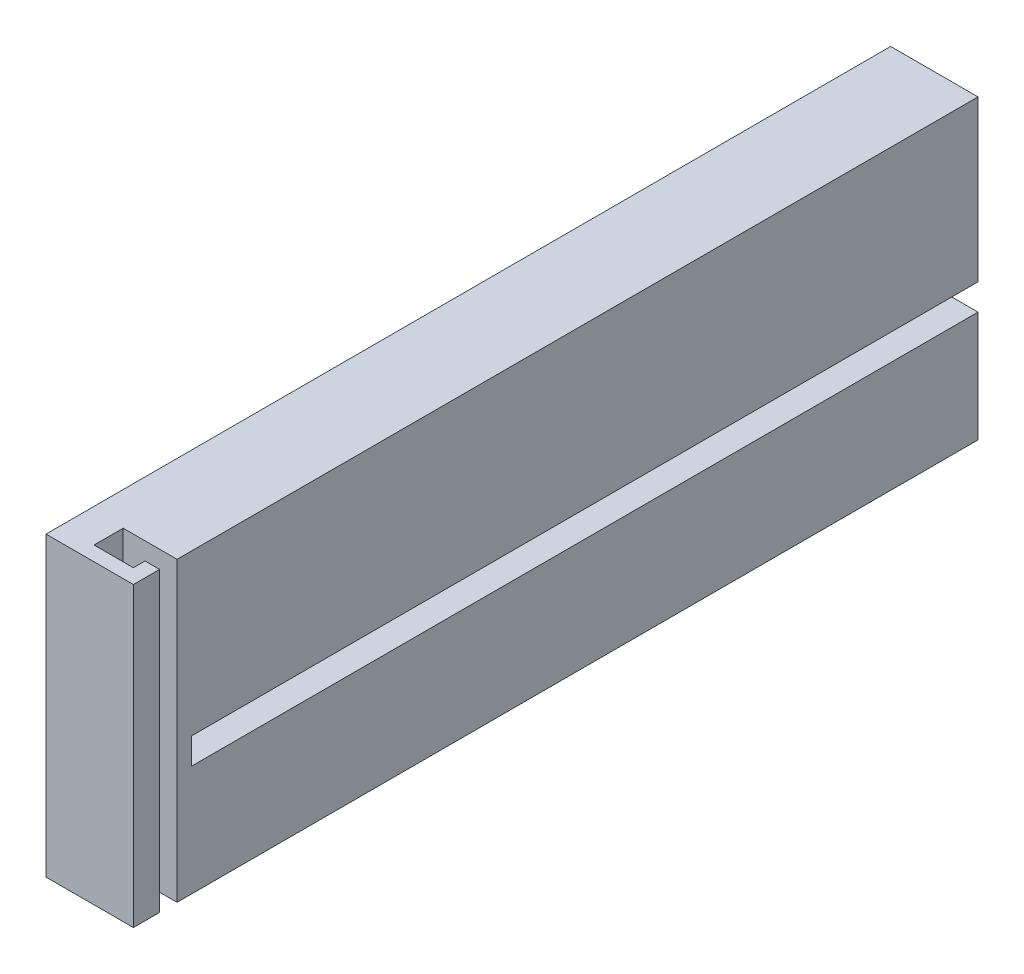
ISO-10303-21;
HEADER;
FILE_DESCRIPTION(('STEP AP214'),'2;1');
FILE_NAME('part.step','',(''),(''),'','','');
FILE_SCHEMA(('AUTOMOTIVE_DESIGN { 1 0 10303 214 1 1 1 1 }'));
ENDSEC;
DATA;
#1=APPLICATION_CONTEXT('core data for automotive mechanical design processes');
#2=APPLICATION_PROTOCOL_DEFINITION('international standard','automotive_design',2000,#1);
#3=PRODUCT_CONTEXT('',#1,'mechanical');
#4=PRODUCT('Part','Part','',(#3));
#5=PRODUCT_RELATED_PRODUCT_CATEGORY('part','',(#4));
#6=PRODUCT_DEFINITION_FORMATION('','',#4);
#7=PRODUCT_DEFINITION_CONTEXT('part definition',#1,'design');
#8=PRODUCT_DEFINITION('design','',#6,#7);
#9=PRODUCT_DEFINITION_SHAPE('','',#8);
#10=(LENGTH_UNIT() NAMED_UNIT(*) SI_UNIT(.MILLI.,.METRE.));
#11=(NAMED_UNIT(*) PLANE_ANGLE_UNIT() SI_UNIT($,.RADIAN.));
#12=(NAMED_UNIT(*) SI_UNIT($,.STERADIAN.) SOLID_ANGLE_UNIT());
#13=UNCERTAINTY_MEASURE_WITH_UNIT(LENGTH_MEASURE(1.E-05),#10,'distance_accuracy_value','');
#14=(GEOMETRIC_REPRESENTATION_CONTEXT(3) GLOBAL_UNCERTAINTY_ASSIGNED_CONTEXT((#13)) GLOBAL_UNIT_ASSIGNED_CONTEXT((#10,
#11,#12)) REPRESENTATION_CONTEXT('',''));
#15=CARTESIAN_POINT('',(0.,0.,0.));
#16=DIRECTION('',(0.,0.,1.));
#17=DIRECTION('',(1.,0.,0.));
#18=AXIS2_PLACEMENT_3D('',#15,#16,#17);
#19=CARTESIAN_POINT('',(15.,0.,0.));
#20=DIRECTION('',(-1.,0.,0.));
#21=DIRECTION('',(0.,0.,1.));
#22=AXIS2_PLACEMENT_3D('',#19,#20,#21);
#23=PLANE('',#22);
#24=DIRECTION('',(0.,0.,-1.));
#25=VECTOR('',#24,1.);
#26=CARTESIAN_POINT('',(15.,-1.4427333974976,54.5620789220404));
#27=LINE('',#26,#25);
#28=CARTESIAN_POINT('',(15.,-1.4427333974976,54.5620789220404));
#29=VERTEX_POINT('',#28);
#30=CARTESIAN_POINT('',(15.,-1.44273339749769,-80.4379210779596));
#31=VERTEX_POINT('',#30);
#32=EDGE_CURVE('E183',#29,#31,#27,.T.);
#33=ORIENTED_EDGE('',*,*,#32,.F.);
#34=DIRECTION('',(0.,-1.,0.));
#35=VECTOR('',#34,1.);
#36=CARTESIAN_POINT('',(15.,0.,54.5620789220404));
#37=LINE('',#36,#35);
#38=CARTESIAN_POINT('',(15.,3.0572666025024,54.5620789220404));
#39=VERTEX_POINT('',#38);
#40=EDGE_CURVE('E163',#39,#29,#37,.T.);
#41=ORIENTED_EDGE('',*,*,#40,.F.);
#42=DIRECTION('',(0.,0.,-1.));
#43=VECTOR('',#42,1.);
#44=CARTESIAN_POINT('',(15.,3.0572666025024,54.5620789220404));
#45=LINE('',#44,#43);
#46=CARTESIAN_POINT('',(15.,3.05726660250231,-80.4379210779596));
#47=VERTEX_POINT('',#46);
#48=EDGE_CURVE('E187',#39,#47,#45,.T.);
#49=ORIENTED_EDGE('',*,*,#48,.T.);
#50=DIRECTION('',(0.,-1.,0.));
#51=VECTOR('',#50,1.);
#52=CARTESIAN_POINT('',(15.,30.5572666025024,-80.4379210779596));
#53=LINE('',#52,#51);
#54=CARTESIAN_POINT('',(15.,30.5572666025024,-80.4379210779596));
#55=VERTEX_POINT('',#54);
#56=EDGE_CURVE('E255',#55,#47,#53,.T.);
#57=ORIENTED_EDGE('',*,*,#56,.F.);
#58=DIRECTION('',(0.,0.,-1.));
#59=VECTOR('',#58,1.);
#60=CARTESIAN_POINT('',(15.,30.5572666025024,64.5620789220404));
#61=LINE('',#60,#59);
#62=CARTESIAN_POINT('',(15.,30.5572666025024,57.0620789220404));
#63=VERTEX_POINT('',#62);
#64=EDGE_CURVE('E254',#63,#55,#61,.T.);
#65=ORIENTED_EDGE('',*,*,#64,.F.);
#66=DIRECTION('',(0.,1.,0.));
#67=VECTOR('',#66,1.);
#68=CARTESIAN_POINT('',(15.,-20.4427333974976,57.0620789220404));
#69=LINE('',#68,#67);
#70=CARTESIAN_POINT('',(15.,-20.4427333974976,57.0620789220404));
#71=VERTEX_POINT('',#70);
#72=EDGE_CURVE('E241',#71,#63,#69,.T.);
#73=ORIENTED_EDGE('',*,*,#72,.F.);
#74=DIRECTION('',(0.,0.,-1.));
#75=VECTOR('',#74,1.);
#76=CARTESIAN_POINT('',(15.,-20.4427333974976,64.5620789220404));
#77=LINE('',#76,#75);
#78=CARTESIAN_POINT('',(15.,-20.4427333974976,-80.4379210779596));
#79=VERTEX_POINT('',#78);
#80=EDGE_CURVE('E259',#71,#79,#77,.T.);
#81=ORIENTED_EDGE('',*,*,#80,.T.);
#82=EDGE_CURVE('E253',#31,#79,#53,.T.);
#83=ORIENTED_EDGE('',*,*,#82,.F.);
#84=EDGE_LOOP('',(#33,#41,#49,#57,#65,#73,#81,#83));
#85=FACE_BOUND('',#84,.T.);
#86=ADVANCED_FACE('F43',(#85),#23,.F.);
#87=CARTESIAN_POINT('',(15.,30.5572666025024,-80.4379210779596));
#88=DIRECTION('',(0.,0.,-1.));
#89=DIRECTION('',(-1.,0.,0.));
#90=AXIS2_PLACEMENT_3D('',#87,#88,#89);
#91=PLANE('',#90);
#92=DIRECTION('',(0.,-1.,0.));
#93=VECTOR('',#92,1.);
#94=CARTESIAN_POINT('',(10.,0.,-80.4379210779596));
#95=LINE('',#94,#93);
#96=CARTESIAN_POINT('',(10.,3.05726660250231,-80.4379210779596));
#97=VERTEX_POINT('',#96);
#98=CARTESIAN_POINT('',(10.,-1.44273339749769,-80.4379210779596));
#99=VERTEX_POINT('',#98);
#100=EDGE_CURVE('E172',#97,#99,#95,.T.);
#101=ORIENTED_EDGE('',*,*,#100,.T.);
#102=DIRECTION('',(1.,0.,0.));
#103=VECTOR('',#102,1.);
#104=CARTESIAN_POINT('',(0.,-1.44273339749768,-80.4379210779596));
#105=LINE('',#104,#103);
#106=EDGE_CURVE('E61',#99,#31,#105,.T.);
#107=ORIENTED_EDGE('',*,*,#106,.T.);
#108=ORIENTED_EDGE('',*,*,#82,.T.);
#109=DIRECTION('',(-1.,0.,0.));
#110=VECTOR('',#109,1.);
#111=CARTESIAN_POINT('',(15.,-20.4427333974976,-80.4379210779596));
#112=LINE('',#111,#110);
#113=CARTESIAN_POINT('',(0.,-20.4427333974976,-80.4379210779596));
#114=VERTEX_POINT('',#113);
#115=EDGE_CURVE('E283',#79,#114,#112,.T.);
#116=ORIENTED_EDGE('',*,*,#115,.T.);
#117=DIRECTION('',(0.,-1.,0.));
#118=VECTOR('',#117,1.);
#119=CARTESIAN_POINT('',(0.,30.5572666025024,-80.4379210779596));
#120=LINE('',#119,#118);
#121=CARTESIAN_POINT('',(0.,30.5572666025024,-80.4379210779596));
#122=VERTEX_POINT('',#121);
#123=EDGE_CURVE('E270',#122,#114,#120,.T.);
#124=ORIENTED_EDGE('',*,*,#123,.F.);
#125=DIRECTION('',(-1.,0.,0.));
#126=VECTOR('',#125,1.);
#127=CARTESIAN_POINT('',(15.,30.5572666025024,-80.4379210779596));
#128=LINE('',#127,#126);
#129=EDGE_CURVE('E47',#55,#122,#128,.T.);
#130=ORIENTED_EDGE('',*,*,#129,.F.);
#131=ORIENTED_EDGE('',*,*,#56,.T.);
#132=DIRECTION('',(1.,0.,0.));
#133=VECTOR('',#132,1.);
#134=CARTESIAN_POINT('',(0.,3.05726660250232,-80.4379210779596));
#135=LINE('',#134,#133);
#136=EDGE_CURVE('E169',#97,#47,#135,.T.);
#137=ORIENTED_EDGE('',*,*,#136,.F.);
#138=EDGE_LOOP('',(#101,#107,#108,#116,#124,#130,#131,#137));
#139=FACE_BOUND('',#138,.T.);
#140=ADVANCED_FACE('F295',(#139),#91,.T.);
#141=CARTESIAN_POINT('',(15.,30.5572666025024,64.5620789220404));
#142=DIRECTION('',(0.,1.,0.));
#143=DIRECTION('',(0.,0.,1.));
#144=AXIS2_PLACEMENT_3D('',#141,#142,#143);
#145=PLANE('',#144);
#146=DIRECTION('',(-1.,0.,0.));
#147=VECTOR('',#146,1.);
#148=CARTESIAN_POINT('',(0.,30.5572666025024,57.0620789220404));
#149=LINE('',#148,#147);
#150=CARTESIAN_POINT('',(5.75,30.5572666025024,57.0620789220404));
#151=VERTEX_POINT('',#150);
#152=EDGE_CURVE('E220',#63,#151,#149,.T.);
#153=ORIENTED_EDGE('',*,*,#152,.F.);
#154=ORIENTED_EDGE('',*,*,#64,.T.);
#155=ORIENTED_EDGE('',*,*,#129,.T.);
#156=DIRECTION('',(0.,0.,-1.));
#157=VECTOR('',#156,1.);
#158=CARTESIAN_POINT('',(0.,30.5572666025024,64.5620789220404));
#159=LINE('',#158,#157);
#160=CARTESIAN_POINT('',(0.,30.5572666025024,64.5620789220404));
#161=VERTEX_POINT('',#160);
#162=EDGE_CURVE('E234',#161,#122,#159,.T.);
#163=ORIENTED_EDGE('',*,*,#162,.F.);
#164=DIRECTION('',(-1.,0.,0.));
#165=VECTOR('',#164,1.);
#166=CARTESIAN_POINT('',(15.,30.5572666025024,64.5620789220404));
#167=LINE('',#166,#165);
#168=CARTESIAN_POINT('',(15.,30.5572666025024,64.5620789220404));
#169=VERTEX_POINT('',#168);
#170=EDGE_CURVE('E11',#169,#161,#167,.T.);
#171=ORIENTED_EDGE('',*,*,#170,.F.);
#172=CARTESIAN_POINT('',(15.,30.5572666025024,60.0620789220404));
#173=VERTEX_POINT('',#172);
#174=EDGE_CURVE('E249',#169,#173,#61,.T.);
#175=ORIENTED_EDGE('',*,*,#174,.T.);
#176=DIRECTION('',(1.,0.,0.));
#177=VECTOR('',#176,1.);
#178=CARTESIAN_POINT('',(0.,30.5572666025024,60.0620789220404));
#179=LINE('',#178,#177);
#180=CARTESIAN_POINT('',(12.5,30.5572666025024,60.0620789220404));
#181=VERTEX_POINT('',#180);
#182=EDGE_CURVE('E69',#181,#173,#179,.T.);
#183=ORIENTED_EDGE('',*,*,#182,.F.);
#184=DIRECTION('',(0.,0.,-1.));
#185=VECTOR('',#184,1.);
#186=CARTESIAN_POINT('',(12.5,30.5572666025024,0.));
#187=LINE('',#186,#185);
#188=CARTESIAN_POINT('',(12.5,30.5572666025024,62.0620789220404));
#189=VERTEX_POINT('',#188);
#190=EDGE_CURVE('E186',#189,#181,#187,.T.);
#191=ORIENTED_EDGE('',*,*,#190,.F.);
#192=DIRECTION('',(1.,0.,0.));
#193=VECTOR('',#192,1.);
#194=CARTESIAN_POINT('',(0.,30.5572666025024,62.0620789220404));
#195=LINE('',#194,#193);
#196=CARTESIAN_POINT('',(5.75,30.5572666025024,62.0620789220404));
#197=VERTEX_POINT('',#196);
#198=EDGE_CURVE('E198',#197,#189,#195,.T.);
#199=ORIENTED_EDGE('',*,*,#198,.F.);
#200=DIRECTION('',(0.,0.,1.));
#201=VECTOR('',#200,1.);
#202=CARTESIAN_POINT('',(5.75,30.5572666025024,0.));
#203=LINE('',#202,#201);
#204=EDGE_CURVE('E224',#151,#197,#203,.T.);
#205=ORIENTED_EDGE('',*,*,#204,.F.);
#206=EDGE_LOOP('',(#153,#154,#155,#163,#171,#175,#183,#191,#199,#205));
#207=FACE_BOUND('',#206,.T.);
#208=ADVANCED_FACE('F45',(#207),#145,.T.);
#209=CARTESIAN_POINT('',(15.,30.5572666025024,64.5620789220404));
#210=DIRECTION('',(0.,0.,-1.));
#211=DIRECTION('',(-1.,0.,0.));
#212=AXIS2_PLACEMENT_3D('',#209,#210,#211);
#213=PLANE('',#212);
#214=DIRECTION('',(0.,-1.,0.));
#215=VECTOR('',#214,1.);
#216=CARTESIAN_POINT('',(0.,30.5572666025024,64.5620789220404));
#217=LINE('',#216,#215);
#218=CARTESIAN_POINT('',(0.,-20.4427333974976,64.5620789220404));
#219=VERTEX_POINT('',#218);
#220=EDGE_CURVE('E278',#161,#219,#217,.T.);
#221=ORIENTED_EDGE('',*,*,#220,.T.);
#222=DIRECTION('',(-1.,0.,0.));
#223=VECTOR('',#222,1.);
#224=CARTESIAN_POINT('',(15.,-20.4427333974976,64.5620789220404));
#225=LINE('',#224,#223);
#226=CARTESIAN_POINT('',(15.,-20.4427333974976,64.5620789220404));
#227=VERTEX_POINT('',#226);
#228=EDGE_CURVE('E53',#227,#219,#225,.T.);
#229=ORIENTED_EDGE('',*,*,#228,.F.);
#230=DIRECTION('',(0.,-1.,0.));
#231=VECTOR('',#230,1.);
#232=CARTESIAN_POINT('',(15.,30.5572666025024,64.5620789220404));
#233=LINE('',#232,#231);
#234=EDGE_CURVE('E264',#169,#227,#233,.T.);
#235=ORIENTED_EDGE('',*,*,#234,.F.);
#236=ORIENTED_EDGE('',*,*,#170,.T.);
#237=EDGE_LOOP('',(#221,#229,#235,#236));
#238=FACE_BOUND('',#237,.T.);
#239=ADVANCED_FACE('F302',(#238),#213,.F.);
#240=CARTESIAN_POINT('',(15.,-20.4427333974976,64.5620789220404));
#241=DIRECTION('',(0.,1.,0.));
#242=DIRECTION('',(0.,0.,1.));
#243=AXIS2_PLACEMENT_3D('',#240,#241,#242);
#244=PLANE('',#243);
#245=ORIENTED_EDGE('',*,*,#80,.F.);
#246=DIRECTION('',(-1.,0.,0.));
#247=VECTOR('',#246,1.);
#248=CARTESIAN_POINT('',(0.,-20.4427333974976,57.0620789220404));
#249=LINE('',#248,#247);
#250=CARTESIAN_POINT('',(5.75,-20.4427333974976,57.0620789220404));
#251=VERTEX_POINT('',#250);
#252=EDGE_CURVE('E202',#71,#251,#249,.T.);
#253=ORIENTED_EDGE('',*,*,#252,.T.);
#254=DIRECTION('',(0.,0.,1.));
#255=VECTOR('',#254,1.);
#256=CARTESIAN_POINT('',(5.75,-20.4427333974976,0.));
#257=LINE('',#256,#255);
#258=CARTESIAN_POINT('',(5.75,-20.4427333974976,62.0620789220404));
#259=VERTEX_POINT('',#258);
#260=EDGE_CURVE('E206',#251,#259,#257,.T.);
#261=ORIENTED_EDGE('',*,*,#260,.T.);
#262=DIRECTION('',(1.,0.,0.));
#263=VECTOR('',#262,1.);
#264=CARTESIAN_POINT('',(0.,-20.4427333974976,62.0620789220404));
#265=LINE('',#264,#263);
#266=CARTESIAN_POINT('',(12.5,-20.4427333974976,62.0620789220404));
#267=VERTEX_POINT('',#266);
#268=EDGE_CURVE('E210',#259,#267,#265,.T.);
#269=ORIENTED_EDGE('',*,*,#268,.T.);
#270=DIRECTION('',(0.,0.,-1.));
#271=VECTOR('',#270,1.);
#272=CARTESIAN_POINT('',(12.5,-20.4427333974976,0.));
#273=LINE('',#272,#271);
#274=CARTESIAN_POINT('',(12.5,-20.4427333974976,60.0620789220404));
#275=VERTEX_POINT('',#274);
#276=EDGE_CURVE('E193',#267,#275,#273,.T.);
#277=ORIENTED_EDGE('',*,*,#276,.T.);
#278=DIRECTION('',(1.,0.,0.));
#279=VECTOR('',#278,1.);
#280=CARTESIAN_POINT('',(0.,-20.4427333974976,60.0620789220404));
#281=LINE('',#280,#279);
#282=CARTESIAN_POINT('',(15.,-20.4427333974976,60.0620789220404));
#283=VERTEX_POINT('',#282);
#284=EDGE_CURVE('E197',#275,#283,#281,.T.);
#285=ORIENTED_EDGE('',*,*,#284,.T.);
#286=EDGE_CURVE('E260',#227,#283,#77,.T.);
#287=ORIENTED_EDGE('',*,*,#286,.F.);
#288=ORIENTED_EDGE('',*,*,#228,.T.);
#289=DIRECTION('',(0.,0.,-1.));
#290=VECTOR('',#289,1.);
#291=CARTESIAN_POINT('',(0.,-20.4427333974976,64.5620789220404));
#292=LINE('',#291,#290);
#293=EDGE_CURVE('E274',#219,#114,#292,.T.);
#294=ORIENTED_EDGE('',*,*,#293,.T.);
#295=ORIENTED_EDGE('',*,*,#115,.F.);
#296=EDGE_LOOP('',(#245,#253,#261,#269,#277,#285,#287,#288,#294,#295));
#297=FACE_BOUND('',#296,.T.);
#298=ADVANCED_FACE('F307',(#297),#244,.F.);
#299=ORIENTED_EDGE('',*,*,#286,.T.);
#300=DIRECTION('',(0.,1.,0.));
#301=VECTOR('',#300,1.);
#302=CARTESIAN_POINT('',(15.,-20.4427333974976,60.0620789220404));
#303=LINE('',#302,#301);
#304=EDGE_CURVE('E244',#283,#173,#303,.T.);
#305=ORIENTED_EDGE('',*,*,#304,.T.);
#306=ORIENTED_EDGE('',*,*,#174,.F.);
#307=ORIENTED_EDGE('',*,*,#234,.T.);
#308=EDGE_LOOP('',(#299,#305,#306,#307));
#309=FACE_BOUND('',#308,.T.);
#310=ADVANCED_FACE('F310',(#309),#23,.F.);
#311=CARTESIAN_POINT('',(0.,0.,0.));
#312=DIRECTION('',(-1.,0.,0.));
#313=DIRECTION('',(0.,0.,1.));
#314=AXIS2_PLACEMENT_3D('',#311,#312,#313);
#315=PLANE('',#314);
#316=ORIENTED_EDGE('',*,*,#162,.T.);
#317=ORIENTED_EDGE('',*,*,#123,.T.);
#318=ORIENTED_EDGE('',*,*,#293,.F.);
#319=ORIENTED_EDGE('',*,*,#220,.F.);
#320=EDGE_LOOP('',(#316,#317,#318,#319));
#321=FACE_BOUND('',#320,.T.);
#322=ADVANCED_FACE('F299',(#321),#315,.T.);
#323=CARTESIAN_POINT('',(12.5,-20.4427333974976,0.));
#324=DIRECTION('',(1.,0.,0.));
#325=DIRECTION('',(0.,0.,-1.));
#326=AXIS2_PLACEMENT_3D('',#323,#324,#325);
#327=PLANE('',#326);
#328=ORIENTED_EDGE('',*,*,#190,.T.);
#329=DIRECTION('',(0.,1.,0.));
#330=VECTOR('',#329,1.);
#331=CARTESIAN_POINT('',(12.5,-20.4427333974976,60.0620789220404));
#332=LINE('',#331,#330);
#333=EDGE_CURVE('E214',#275,#181,#332,.T.);
#334=ORIENTED_EDGE('',*,*,#333,.F.);
#335=ORIENTED_EDGE('',*,*,#276,.F.);
#336=DIRECTION('',(0.,1.,0.));
#337=VECTOR('',#336,1.);
#338=CARTESIAN_POINT('',(12.5,-20.4427333974976,62.0620789220404));
#339=LINE('',#338,#337);
#340=EDGE_CURVE('E231',#267,#189,#339,.T.);
#341=ORIENTED_EDGE('',*,*,#340,.T.);
#342=EDGE_LOOP('',(#328,#334,#335,#341));
#343=FACE_BOUND('',#342,.T.);
#344=ADVANCED_FACE('F316',(#343),#327,.F.);
#345=CARTESIAN_POINT('',(0.,-20.4427333974976,62.0620789220404));
#346=DIRECTION('',(0.,0.,1.));
#347=DIRECTION('',(1.,0.,0.));
#348=AXIS2_PLACEMENT_3D('',#345,#346,#347);
#349=PLANE('',#348);
#350=ORIENTED_EDGE('',*,*,#198,.T.);
#351=ORIENTED_EDGE('',*,*,#340,.F.);
#352=ORIENTED_EDGE('',*,*,#268,.F.);
#353=DIRECTION('',(0.,1.,0.));
#354=VECTOR('',#353,1.);
#355=CARTESIAN_POINT('',(5.75,-20.4427333974976,62.0620789220404));
#356=LINE('',#355,#354);
#357=EDGE_CURVE('E235',#259,#197,#356,.T.);
#358=ORIENTED_EDGE('',*,*,#357,.T.);
#359=EDGE_LOOP('',(#350,#351,#352,#358));
#360=FACE_BOUND('',#359,.T.);
#361=ADVANCED_FACE('F320',(#360),#349,.F.);
#362=CARTESIAN_POINT('',(5.75,-20.4427333974976,0.));
#363=DIRECTION('',(-1.,0.,0.));
#364=DIRECTION('',(0.,0.,1.));
#365=AXIS2_PLACEMENT_3D('',#362,#363,#364);
#366=PLANE('',#365);
#367=ORIENTED_EDGE('',*,*,#204,.T.);
#368=ORIENTED_EDGE('',*,*,#357,.F.);
#369=ORIENTED_EDGE('',*,*,#260,.F.);
#370=DIRECTION('',(0.,1.,0.));
#371=VECTOR('',#370,1.);
#372=CARTESIAN_POINT('',(5.75,-20.4427333974976,57.0620789220404));
#373=LINE('',#372,#371);
#374=EDGE_CURVE('E238',#251,#151,#373,.T.);
#375=ORIENTED_EDGE('',*,*,#374,.T.);
#376=EDGE_LOOP('',(#367,#368,#369,#375));
#377=FACE_BOUND('',#376,.T.);
#378=ADVANCED_FACE('F323',(#377),#366,.F.);
#379=CARTESIAN_POINT('',(0.,-20.4427333974976,57.0620789220404));
#380=DIRECTION('',(0.,0.,-1.));
#381=DIRECTION('',(-1.,0.,0.));
#382=AXIS2_PLACEMENT_3D('',#379,#380,#381);
#383=PLANE('',#382);
#384=ORIENTED_EDGE('',*,*,#152,.T.);
#385=ORIENTED_EDGE('',*,*,#374,.F.);
#386=ORIENTED_EDGE('',*,*,#252,.F.);
#387=ORIENTED_EDGE('',*,*,#72,.T.);
#388=EDGE_LOOP('',(#384,#385,#386,#387));
#389=FACE_BOUND('',#388,.T.);
#390=ADVANCED_FACE('F332',(#389),#383,.F.);
#391=CARTESIAN_POINT('',(0.,-20.4427333974976,60.0620789220404));
#392=DIRECTION('',(0.,0.,1.));
#393=DIRECTION('',(1.,0.,0.));
#394=AXIS2_PLACEMENT_3D('',#391,#392,#393);
#395=PLANE('',#394);
#396=ORIENTED_EDGE('',*,*,#182,.T.);
#397=ORIENTED_EDGE('',*,*,#304,.F.);
#398=ORIENTED_EDGE('',*,*,#284,.F.);
#399=ORIENTED_EDGE('',*,*,#333,.T.);
#400=EDGE_LOOP('',(#396,#397,#398,#399));
#401=FACE_BOUND('',#400,.T.);
#402=ADVANCED_FACE('F334',(#401),#395,.F.);
#403=CARTESIAN_POINT('',(0.,-1.4427333974976,54.5620789220404));
#404=DIRECTION('',(0.,1.,0.));
#405=DIRECTION('',(0.,0.,1.));
#406=AXIS2_PLACEMENT_3D('',#403,#404,#405);
#407=PLANE('',#406);
#408=ORIENTED_EDGE('',*,*,#106,.F.);
#409=DIRECTION('',(0.,0.,-1.));
#410=VECTOR('',#409,1.);
#411=CARTESIAN_POINT('',(10.,-1.4427333974976,54.5620789220404));
#412=LINE('',#411,#410);
#413=CARTESIAN_POINT('',(10.,-1.4427333974976,54.5620789220404));
#414=VERTEX_POINT('',#413);
#415=EDGE_CURVE('E149',#414,#99,#412,.T.);
#416=ORIENTED_EDGE('',*,*,#415,.F.);
#417=DIRECTION('',(1.,0.,0.));
#418=VECTOR('',#417,1.);
#419=CARTESIAN_POINT('',(0.,-1.4427333974976,54.5620789220404));
#420=LINE('',#419,#418);
#421=EDGE_CURVE('E158',#414,#29,#420,.T.);
#422=ORIENTED_EDGE('',*,*,#421,.T.);
#423=ORIENTED_EDGE('',*,*,#32,.T.);
#424=EDGE_LOOP('',(#408,#416,#422,#423));
#425=FACE_BOUND('',#424,.T.);
#426=ADVANCED_FACE('F160',(#425),#407,.T.);
#427=CARTESIAN_POINT('',(0.,3.0572666025024,54.5620789220404));
#428=DIRECTION('',(0.,1.,0.));
#429=DIRECTION('',(0.,0.,1.));
#430=AXIS2_PLACEMENT_3D('',#427,#428,#429);
#431=PLANE('',#430);
#432=ORIENTED_EDGE('',*,*,#136,.T.);
#433=ORIENTED_EDGE('',*,*,#48,.F.);
#434=DIRECTION('',(1.,0.,0.));
#435=VECTOR('',#434,1.);
#436=CARTESIAN_POINT('',(0.,3.0572666025024,54.5620789220404));
#437=LINE('',#436,#435);
#438=CARTESIAN_POINT('',(10.,3.0572666025024,54.5620789220404));
#439=VERTEX_POINT('',#438);
#440=EDGE_CURVE('E157',#439,#39,#437,.T.);
#441=ORIENTED_EDGE('',*,*,#440,.F.);
#442=DIRECTION('',(0.,0.,-1.));
#443=VECTOR('',#442,1.);
#444=CARTESIAN_POINT('',(10.,3.0572666025024,54.5620789220404));
#445=LINE('',#444,#443);
#446=EDGE_CURVE('E151',#439,#97,#445,.T.);
#447=ORIENTED_EDGE('',*,*,#446,.T.);
#448=EDGE_LOOP('',(#432,#433,#441,#447));
#449=FACE_BOUND('',#448,.T.);
#450=ADVANCED_FACE('F383',(#449),#431,.F.);
#451=CARTESIAN_POINT('',(10.,0.,54.5620789220404));
#452=DIRECTION('',(1.,0.,0.));
#453=DIRECTION('',(0.,0.,-1.));
#454=AXIS2_PLACEMENT_3D('',#451,#452,#453);
#455=PLANE('',#454);
#456=ORIENTED_EDGE('',*,*,#100,.F.);
#457=ORIENTED_EDGE('',*,*,#446,.F.);
#458=DIRECTION('',(0.,-1.,0.));
#459=VECTOR('',#458,1.);
#460=CARTESIAN_POINT('',(10.,0.,54.5620789220404));
#461=LINE('',#460,#459);
#462=EDGE_CURVE('E146',#439,#414,#461,.T.);
#463=ORIENTED_EDGE('',*,*,#462,.T.);
#464=ORIENTED_EDGE('',*,*,#415,.T.);
#465=EDGE_LOOP('',(#456,#457,#463,#464));
#466=FACE_BOUND('',#465,.T.);
#467=ADVANCED_FACE('F148',(#466),#455,.T.);
#468=CARTESIAN_POINT('',(0.,0.,54.5620789220404));
#469=DIRECTION('',(0.,0.,-1.));
#470=DIRECTION('',(0.,1.,0.));
#471=AXIS2_PLACEMENT_3D('',#468,#469,#470);
#472=PLANE('',#471);
#473=ORIENTED_EDGE('',*,*,#421,.F.);
#474=ORIENTED_EDGE('',*,*,#462,.F.);
#475=ORIENTED_EDGE('',*,*,#440,.T.);
#476=ORIENTED_EDGE('',*,*,#40,.T.);
#477=EDGE_LOOP('',(#473,#474,#475,#476));
#478=FACE_BOUND('',#477,.T.);
#479=ADVANCED_FACE('F165',(#478),#472,.T.);
#480=CLOSED_SHELL('',(#86,#140,#208,#239,#298,#310,#322,#344,#361,#378,#390,#402,#426,#450,#467,#479));
#481=MANIFOLD_SOLID_BREP('B2',#480);
#482=ADVANCED_BREP_SHAPE_REPRESENTATION('',(#18,#481),#14);
#483=SHAPE_DEFINITION_REPRESENTATION(#9,#482);
ENDSEC;
END-ISO-10303-21;
